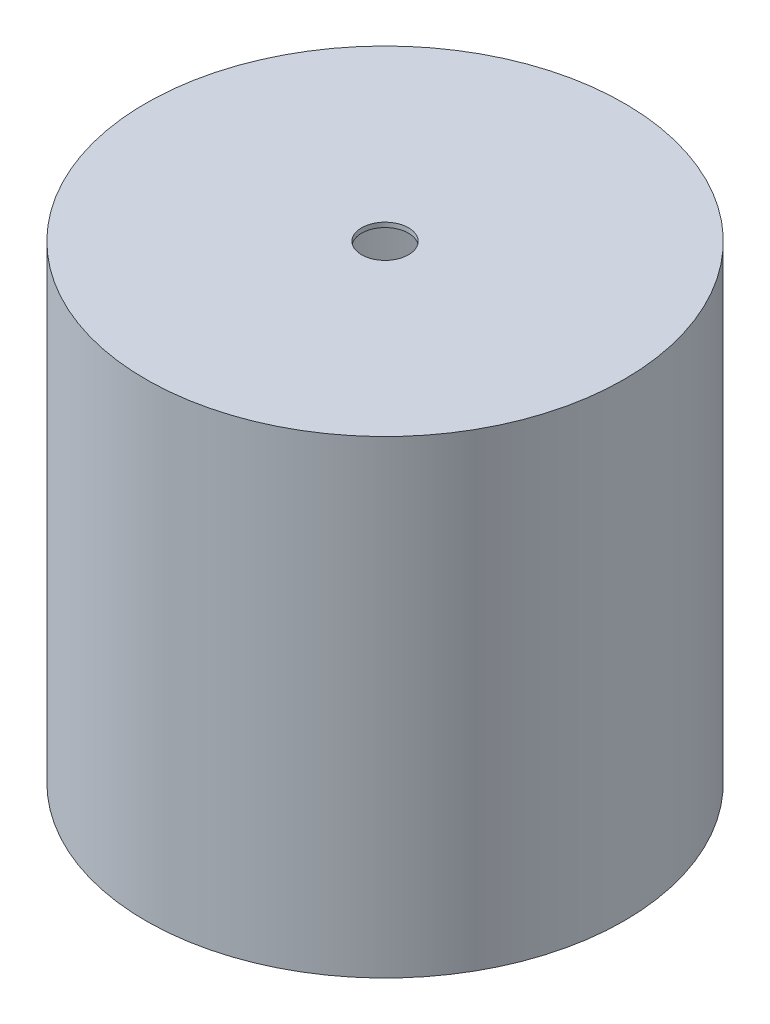
ISO-10303-21;
HEADER;
FILE_DESCRIPTION(('STEP AP214'),'2;1');
FILE_NAME('part.step','',(''),(''),'','','');
FILE_SCHEMA(('AUTOMOTIVE_DESIGN { 1 0 10303 214 1 1 1 1 }'));
ENDSEC;
DATA;
#1=APPLICATION_CONTEXT('core data for automotive mechanical design processes');
#2=APPLICATION_PROTOCOL_DEFINITION('international standard','automotive_design',2000,#1);
#3=PRODUCT_CONTEXT('',#1,'mechanical');
#4=PRODUCT('Part','Part','',(#3));
#5=PRODUCT_RELATED_PRODUCT_CATEGORY('part','',(#4));
#6=PRODUCT_DEFINITION_FORMATION('','',#4);
#7=PRODUCT_DEFINITION_CONTEXT('part definition',#1,'design');
#8=PRODUCT_DEFINITION('design','',#6,#7);
#9=PRODUCT_DEFINITION_SHAPE('','',#8);
#10=(LENGTH_UNIT() NAMED_UNIT(*) SI_UNIT(.MILLI.,.METRE.));
#11=(NAMED_UNIT(*) PLANE_ANGLE_UNIT() SI_UNIT($,.RADIAN.));
#12=(NAMED_UNIT(*) SI_UNIT($,.STERADIAN.) SOLID_ANGLE_UNIT());
#13=UNCERTAINTY_MEASURE_WITH_UNIT(LENGTH_MEASURE(1.E-05),#10,'distance_accuracy_value','');
#14=(GEOMETRIC_REPRESENTATION_CONTEXT(3) GLOBAL_UNCERTAINTY_ASSIGNED_CONTEXT((#13)) GLOBAL_UNIT_ASSIGNED_CONTEXT((#10,
#11,#12)) REPRESENTATION_CONTEXT('',''));
#15=CARTESIAN_POINT('',(0.,0.,0.));
#16=DIRECTION('',(0.,0.,1.));
#17=DIRECTION('',(1.,0.,0.));
#18=AXIS2_PLACEMENT_3D('',#15,#16,#17);
#19=CARTESIAN_POINT('',(0.,1.,0.));
#20=DIRECTION('',(0.,1.,0.));
#21=DIRECTION('',(0.,0.,1.));
#22=AXIS2_PLACEMENT_3D('',#19,#20,#21);
#23=PLANE('',#22);
#24=CARTESIAN_POINT('',(0.,1.,0.));
#25=DIRECTION('',(0.,1.,0.));
#26=DIRECTION('',(0.,0.,1.));
#27=AXIS2_PLACEMENT_3D('',#24,#25,#26);
#28=CIRCLE('',#27,5.);
#29=CARTESIAN_POINT('',(0.,1.,5.));
#30=VERTEX_POINT('',#29);
#31=EDGE_CURVE('E56',#30,#30,#28,.T.);
#32=ORIENTED_EDGE('',*,*,#31,.F.);
#33=EDGE_LOOP('',(#32));
#34=FACE_BOUND('',#33,.T.);
#35=CARTESIAN_POINT('',(0.,1.,0.));
#36=DIRECTION('',(0.,1.,0.));
#37=DIRECTION('',(0.,0.,1.));
#38=AXIS2_PLACEMENT_3D('',#35,#36,#37);
#39=CIRCLE('',#38,50.);
#40=CARTESIAN_POINT('',(0.,1.,50.));
#41=VERTEX_POINT('',#40);
#42=EDGE_CURVE('E11',#41,#41,#39,.T.);
#43=ORIENTED_EDGE('',*,*,#42,.T.);
#44=EDGE_LOOP('',(#43));
#45=FACE_BOUND('',#44,.T.);
#46=ADVANCED_FACE('F36',(#34,#45),#23,.T.);
#47=CARTESIAN_POINT('',(0.,100.,0.));
#48=DIRECTION('',(0.,-1.,0.));
#49=DIRECTION('',(0.,0.,-1.));
#50=AXIS2_PLACEMENT_3D('',#47,#48,#49);
#51=CYLINDRICAL_SURFACE('',#50,50.);
#52=ORIENTED_EDGE('',*,*,#42,.F.);
#53=EDGE_LOOP('',(#52));
#54=FACE_BOUND('',#53,.T.);
#55=CARTESIAN_POINT('',(0.,99.,0.));
#56=DIRECTION('',(0.,1.,0.));
#57=DIRECTION('',(0.,0.,1.));
#58=AXIS2_PLACEMENT_3D('',#55,#56,#57);
#59=CIRCLE('',#58,50.);
#60=CARTESIAN_POINT('',(0.,99.,50.));
#61=VERTEX_POINT('',#60);
#62=EDGE_CURVE('E52',#61,#61,#59,.T.);
#63=ORIENTED_EDGE('',*,*,#62,.T.);
#64=EDGE_LOOP('',(#63));
#65=FACE_BOUND('',#64,.T.);
#66=ADVANCED_FACE('F83',(#54,#65),#51,.F.);
#67=CARTESIAN_POINT('',(0.,99.,0.));
#68=DIRECTION('',(0.,1.,0.));
#69=DIRECTION('',(0.,0.,1.));
#70=AXIS2_PLACEMENT_3D('',#67,#68,#69);
#71=PLANE('',#70);
#72=CARTESIAN_POINT('',(0.,99.,0.));
#73=DIRECTION('',(0.,1.,0.));
#74=DIRECTION('',(0.,0.,1.));
#75=AXIS2_PLACEMENT_3D('',#72,#73,#74);
#76=CIRCLE('',#75,5.);
#77=CARTESIAN_POINT('',(0.,99.,5.));
#78=VERTEX_POINT('',#77);
#79=EDGE_CURVE('E40',#78,#78,#76,.T.);
#80=ORIENTED_EDGE('',*,*,#79,.T.);
#81=EDGE_LOOP('',(#80));
#82=FACE_BOUND('',#81,.T.);
#83=ORIENTED_EDGE('',*,*,#62,.F.);
#84=EDGE_LOOP('',(#83));
#85=FACE_BOUND('',#84,.T.);
#86=ADVANCED_FACE('F69',(#82,#85),#71,.F.);
#87=CARTESIAN_POINT('',(0.,100.,0.));
#88=DIRECTION('',(0.,-1.,0.));
#89=DIRECTION('',(0.,0.,-1.));
#90=AXIS2_PLACEMENT_3D('',#87,#88,#89);
#91=CYLINDRICAL_SURFACE('',#90,5.);
#92=CARTESIAN_POINT('',(0.,100.,0.));
#93=DIRECTION('',(0.,-1.,0.));
#94=DIRECTION('',(0.,0.,-1.));
#95=AXIS2_PLACEMENT_3D('',#92,#93,#94);
#96=CIRCLE('',#95,5.);
#97=CARTESIAN_POINT('',(0.,100.,-5.));
#98=VERTEX_POINT('',#97);
#99=EDGE_CURVE('E62',#98,#98,#96,.T.);
#100=ORIENTED_EDGE('',*,*,#99,.F.);
#101=EDGE_LOOP('',(#100));
#102=FACE_BOUND('',#101,.T.);
#103=ORIENTED_EDGE('',*,*,#79,.F.);
#104=EDGE_LOOP('',(#103));
#105=FACE_BOUND('',#104,.T.);
#106=ADVANCED_FACE('F72',(#102,#105),#91,.F.);
#107=ORIENTED_EDGE('',*,*,#31,.T.);
#108=EDGE_LOOP('',(#107));
#109=FACE_BOUND('',#108,.T.);
#110=CARTESIAN_POINT('',(0.,0.,0.));
#111=DIRECTION('',(0.,-1.,0.));
#112=DIRECTION('',(0.,0.,-1.));
#113=AXIS2_PLACEMENT_3D('',#110,#111,#112);
#114=CIRCLE('',#113,5.);
#115=CARTESIAN_POINT('',(0.,0.,-5.));
#116=VERTEX_POINT('',#115);
#117=EDGE_CURVE('E59',#116,#116,#114,.T.);
#118=ORIENTED_EDGE('',*,*,#117,.T.);
#119=EDGE_LOOP('',(#118));
#120=FACE_BOUND('',#119,.T.);
#121=ADVANCED_FACE('F74',(#109,#120),#91,.F.);
#122=CARTESIAN_POINT('',(0.,100.,0.));
#123=DIRECTION('',(0.,1.,0.));
#124=DIRECTION('',(0.,0.,1.));
#125=AXIS2_PLACEMENT_3D('',#122,#123,#124);
#126=PLANE('',#125);
#127=ORIENTED_EDGE('',*,*,#99,.T.);
#128=EDGE_LOOP('',(#127));
#129=FACE_BOUND('',#128,.T.);
#130=CARTESIAN_POINT('',(0.,100.,0.));
#131=DIRECTION('',(0.,1.,0.));
#132=DIRECTION('',(1.,0.,0.));
#133=AXIS2_PLACEMENT_3D('',#130,#131,#132);
#134=CIRCLE('',#133,51.);
#135=CARTESIAN_POINT('',(51.,100.,0.));
#136=VERTEX_POINT('',#135);
#137=EDGE_CURVE('E44',#136,#136,#134,.T.);
#138=ORIENTED_EDGE('',*,*,#137,.T.);
#139=EDGE_LOOP('',(#138));
#140=FACE_BOUND('',#139,.T.);
#141=ADVANCED_FACE('F81',(#129,#140),#126,.T.);
#142=CARTESIAN_POINT('',(0.,0.,0.));
#143=DIRECTION('',(0.,1.,0.));
#144=DIRECTION('',(0.,0.,1.));
#145=AXIS2_PLACEMENT_3D('',#142,#143,#144);
#146=PLANE('',#145);
#147=ORIENTED_EDGE('',*,*,#117,.F.);
#148=EDGE_LOOP('',(#147));
#149=FACE_BOUND('',#148,.T.);
#150=CARTESIAN_POINT('',(0.,0.,0.));
#151=DIRECTION('',(0.,1.,0.));
#152=DIRECTION('',(1.,0.,0.));
#153=AXIS2_PLACEMENT_3D('',#150,#151,#152);
#154=CIRCLE('',#153,51.);
#155=CARTESIAN_POINT('',(51.,0.,0.));
#156=VERTEX_POINT('',#155);
#157=EDGE_CURVE('E48',#156,#156,#154,.T.);
#158=ORIENTED_EDGE('',*,*,#157,.F.);
#159=EDGE_LOOP('',(#158));
#160=FACE_BOUND('',#159,.T.);
#161=ADVANCED_FACE('F96',(#149,#160),#146,.F.);
#162=CARTESIAN_POINT('',(0.,100.,0.));
#163=DIRECTION('',(0.,-1.,0.));
#164=DIRECTION('',(0.,0.,-1.));
#165=AXIS2_PLACEMENT_3D('',#162,#163,#164);
#166=CYLINDRICAL_SURFACE('',#165,51.);
#167=ORIENTED_EDGE('',*,*,#137,.F.);
#168=EDGE_LOOP('',(#167));
#169=FACE_BOUND('',#168,.T.);
#170=ORIENTED_EDGE('',*,*,#157,.T.);
#171=EDGE_LOOP('',(#170));
#172=FACE_BOUND('',#171,.T.);
#173=ADVANCED_FACE('F38',(#169,#172),#166,.T.);
#174=CLOSED_SHELL('',(#46,#66,#86,#106,#121,#141,#161,#173));
#175=MANIFOLD_SOLID_BREP('B2',#174);
#176=ADVANCED_BREP_SHAPE_REPRESENTATION('',(#18,#175),#14);
#177=SHAPE_DEFINITION_REPRESENTATION(#9,#176);
ENDSEC;
END-ISO-10303-21;
